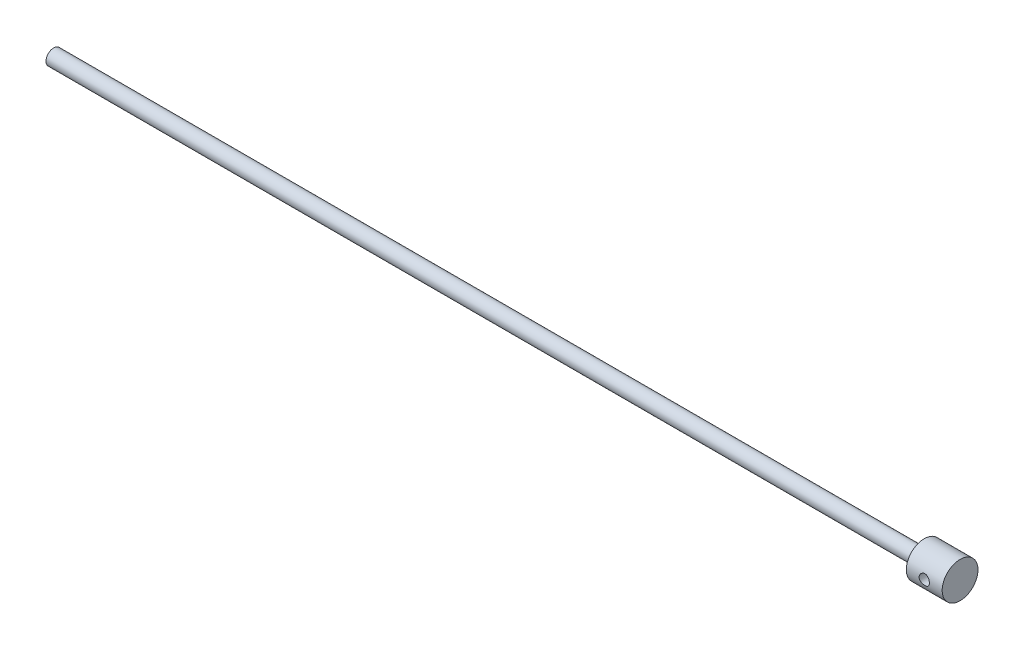
ISO-10303-21;
HEADER;
FILE_DESCRIPTION(('STEP AP214'),'2;1');
FILE_NAME('part.step','',(''),(''),'','','');
FILE_SCHEMA(('AUTOMOTIVE_DESIGN { 1 0 10303 214 1 1 1 1 }'));
ENDSEC;
DATA;
#1=APPLICATION_CONTEXT('core data for automotive mechanical design processes');
#2=APPLICATION_PROTOCOL_DEFINITION('international standard','automotive_design',2000,#1);
#3=PRODUCT_CONTEXT('',#1,'mechanical');
#4=PRODUCT('Part','Part','',(#3));
#5=PRODUCT_RELATED_PRODUCT_CATEGORY('part','',(#4));
#6=PRODUCT_DEFINITION_FORMATION('','',#4);
#7=PRODUCT_DEFINITION_CONTEXT('part definition',#1,'design');
#8=PRODUCT_DEFINITION('design','',#6,#7);
#9=PRODUCT_DEFINITION_SHAPE('','',#8);
#10=(LENGTH_UNIT() NAMED_UNIT(*) SI_UNIT(.MILLI.,.METRE.));
#11=(NAMED_UNIT(*) PLANE_ANGLE_UNIT() SI_UNIT($,.RADIAN.));
#12=(NAMED_UNIT(*) SI_UNIT($,.STERADIAN.) SOLID_ANGLE_UNIT());
#13=UNCERTAINTY_MEASURE_WITH_UNIT(LENGTH_MEASURE(1.E-05),#10,'distance_accuracy_value','');
#14=(GEOMETRIC_REPRESENTATION_CONTEXT(3) GLOBAL_UNCERTAINTY_ASSIGNED_CONTEXT((#13)) GLOBAL_UNIT_ASSIGNED_CONTEXT((#10,
#11,#12)) REPRESENTATION_CONTEXT('',''));
#15=CARTESIAN_POINT('',(0.,0.,0.));
#16=DIRECTION('',(0.,0.,1.));
#17=DIRECTION('',(1.,0.,0.));
#18=AXIS2_PLACEMENT_3D('',#15,#16,#17);
#19=CARTESIAN_POINT('',(-850.,0.,0.));
#20=DIRECTION('',(1.,0.,0.));
#21=DIRECTION('',(0.,0.,-1.));
#22=AXIS2_PLACEMENT_3D('',#19,#20,#21);
#23=CYLINDRICAL_SURFACE('',#22,7.5);
#24=CARTESIAN_POINT('',(-850.,0.,0.));
#25=DIRECTION('',(1.,0.,0.));
#26=DIRECTION('',(0.,0.,-1.));
#27=AXIS2_PLACEMENT_3D('',#24,#25,#26);
#28=CIRCLE('',#27,7.5);
#29=CARTESIAN_POINT('',(-850.,0.,-7.5));
#30=VERTEX_POINT('',#29);
#31=EDGE_CURVE('E47',#30,#30,#28,.T.);
#32=ORIENTED_EDGE('',*,*,#31,.T.);
#33=EDGE_LOOP('',(#32));
#34=FACE_BOUND('',#33,.T.);
#35=CARTESIAN_POINT('',(0.,0.,0.));
#36=DIRECTION('',(1.,0.,0.));
#37=DIRECTION('',(0.,0.,-1.));
#38=AXIS2_PLACEMENT_3D('',#35,#36,#37);
#39=CIRCLE('',#38,7.5);
#40=CARTESIAN_POINT('',(0.,0.,-7.5));
#41=VERTEX_POINT('',#40);
#42=EDGE_CURVE('E51',#41,#41,#39,.T.);
#43=ORIENTED_EDGE('',*,*,#42,.F.);
#44=EDGE_LOOP('',(#43));
#45=FACE_BOUND('',#44,.T.);
#46=ADVANCED_FACE('F32',(#34,#45),#23,.T.);
#47=CARTESIAN_POINT('',(-850.,0.,0.));
#48=DIRECTION('',(1.,0.,0.));
#49=DIRECTION('',(0.,0.,-1.));
#50=AXIS2_PLACEMENT_3D('',#47,#48,#49);
#51=PLANE('',#50);
#52=ORIENTED_EDGE('',*,*,#31,.F.);
#53=EDGE_LOOP('',(#52));
#54=FACE_BOUND('',#53,.T.);
#55=ADVANCED_FACE('F77',(#54),#51,.F.);
#56=CARTESIAN_POINT('',(35.,0.,0.));
#57=DIRECTION('',(-1.,0.,0.));
#58=DIRECTION('',(0.,0.,1.));
#59=AXIS2_PLACEMENT_3D('',#56,#57,#58);
#60=CYLINDRICAL_SURFACE('',#59,17.5);
#61=CARTESIAN_POINT('',(22.5,0.,-17.5));
#62=CARTESIAN_POINT('',(22.4999951510951,0.274887255943128,-17.4999967323586));
#63=CARTESIAN_POINT('',(22.4772555275597,0.549824369681453,-17.4934604350511));
#64=CARTESIAN_POINT('',(22.3870893247442,1.09172997799247,-17.4680226486276));
#65=CARTESIAN_POINT('',(22.3196458348148,1.35869541707404,-17.4491164802521));
#66=CARTESIAN_POINT('',(22.1424799039587,1.87676075184468,-17.4010172837268));
#67=CARTESIAN_POINT('',(22.0328164096201,2.12788220212056,-17.3718386026585));
#68=CARTESIAN_POINT('',(21.7745550213041,2.60817190282318,-17.3062494579136));
#69=CARTESIAN_POINT('',(21.6259530537741,2.83733785294541,-17.2698382377007));
#70=CARTESIAN_POINT('',(21.2899124733177,3.27323611714736,-17.1926183656394));
#71=CARTESIAN_POINT('',(21.1016381153618,3.47930930595233,-17.1517260486293));
#72=CARTESIAN_POINT('',(20.6933806421558,3.85742839481089,-17.0706683728915));
#73=CARTESIAN_POINT('',(20.4733927809195,4.02946919269461,-17.0305031239854));
#74=CARTESIAN_POINT('',(20.0025160430226,4.33799475016071,-16.9545753718829));
#75=CARTESIAN_POINT('',(19.7510950373375,4.47369552758352,-16.9189175626436));
#76=CARTESIAN_POINT('',(19.2278199706235,4.7006292638497,-16.8572835960235));
#77=CARTESIAN_POINT('',(18.9559703198242,4.79187178889368,-16.8313053561473));
#78=CARTESIAN_POINT('',(18.4069130920848,4.92496082534619,-16.7928402048756));
#79=CARTESIAN_POINT('',(18.1300215930753,4.9680138300687,-16.7800244641586));
#80=CARTESIAN_POINT('',(17.5726721288899,5.00726669473215,-16.7683552051415));
#81=CARTESIAN_POINT('',(17.2922149518936,5.00347673524998,-16.769498653032));
#82=CARTESIAN_POINT('',(16.7453284713328,4.95010336906261,-16.7853258599179));
#83=CARTESIAN_POINT('',(16.4787391219636,4.90200814317314,-16.7995695662338));
#84=CARTESIAN_POINT('',(15.9575819508506,4.76378465210904,-16.8392837083571));
#85=CARTESIAN_POINT('',(15.7030152181801,4.67365258702332,-16.8647551590827));
#86=CARTESIAN_POINT('',(15.2093843889463,4.45276702845641,-16.9244215882327));
#87=CARTESIAN_POINT('',(14.9705573190027,4.32151377932501,-16.95872291023));
#88=CARTESIAN_POINT('',(14.5178085969596,4.02245947919413,-17.0321304219627));
#89=CARTESIAN_POINT('',(14.3038925056608,3.8546502918328,-17.0712376805236));
#90=CARTESIAN_POINT('',(13.898569060986,3.47975999182636,-17.151656266434));
#91=CARTESIAN_POINT('',(13.7083138100825,3.27143718711354,-17.1929951143159));
#92=CARTESIAN_POINT('',(13.3651849908988,2.82533070596533,-17.2719061804519));
#93=CARTESIAN_POINT('',(13.2123133598956,2.58754550370467,-17.3094782034438));
#94=CARTESIAN_POINT('',(12.947678163065,2.08730768272867,-17.3769132016394));
#95=CARTESIAN_POINT('',(12.8361492829896,1.82472454452503,-17.4067318874312));
#96=CARTESIAN_POINT('',(12.6591652714579,1.28348307491865,-17.4549812871892));
#97=CARTESIAN_POINT('',(12.5936985268868,1.00482881452536,-17.4734148714063));
#98=CARTESIAN_POINT('',(12.5125667857264,0.449165971610878,-17.4963718628669));
#99=CARTESIAN_POINT('',(12.4953382615674,0.17240336715127,-17.501331821265));
#100=CARTESIAN_POINT('',(12.5068181657526,-0.380066317013958,-17.4980521176773));
#101=CARTESIAN_POINT('',(12.5355210821148,-0.65577351939277,-17.4898140395157));
#102=CARTESIAN_POINT('',(12.6367761107906,-1.19254658357579,-17.4613481671301));
#103=CARTESIAN_POINT('',(12.7084329533085,-1.45379552933711,-17.4413653254419));
#104=CARTESIAN_POINT('',(12.8925012549617,-1.9605217155141,-17.3916999685472));
#105=CARTESIAN_POINT('',(13.0049174272233,-2.20599712812179,-17.3620163316471));
#106=CARTESIAN_POINT('',(13.2700583416128,-2.68010421280008,-17.2952490292284));
#107=CARTESIAN_POINT('',(13.4236029970633,-2.90825621635022,-17.2580190794575));
#108=CARTESIAN_POINT('',(13.7656312648777,-3.33609632014869,-17.180448677462));
#109=CARTESIAN_POINT('',(13.9541228251614,-3.53577792710763,-17.1401075188813));
#110=CARTESIAN_POINT('',(14.3680233551237,-3.90776607085016,-17.0592154907323));
#111=CARTESIAN_POINT('',(14.5944381888979,-4.07896356851775,-17.0187009214433));
#112=CARTESIAN_POINT('',(15.0736564715614,-4.380988290169,-16.9434723683839));
#113=CARTESIAN_POINT('',(15.3264590019272,-4.51181691871705,-16.9087581828186));
#114=CARTESIAN_POINT('',(15.850228027439,-4.72843635295665,-16.8494662810178));
#115=CARTESIAN_POINT('',(16.1210894087477,-4.81446583099021,-16.8248350005383));
#116=CARTESIAN_POINT('',(16.6742748389333,-4.93948625169788,-16.7885614169356));
#117=CARTESIAN_POINT('',(16.9565953876774,-4.9784914475439,-16.7769151780959));
#118=CARTESIAN_POINT('',(17.5132400823757,-5.00745060616827,-16.7682925774812));
#119=CARTESIAN_POINT('',(17.7874637614812,-4.99920069109392,-16.7707790176036));
#120=CARTESIAN_POINT('',(18.3304368267331,-4.93811777392153,-16.7888649275624));
#121=CARTESIAN_POINT('',(18.5991863952422,-4.88528625949613,-16.8044639598361));
#122=CARTESIAN_POINT('',(19.1209459278904,-4.73764922042289,-16.8466744296963));
#123=CARTESIAN_POINT('',(19.3740884675196,-4.64327729466074,-16.8731719264076));
#124=CARTESIAN_POINT('',(19.8611468362388,-4.41557373253792,-16.9341825708695));
#125=CARTESIAN_POINT('',(20.0950592531853,-4.28223520107837,-16.9686971370099));
#126=CARTESIAN_POINT('',(20.545458804511,-3.97516366337117,-17.0432917237999));
#127=CARTESIAN_POINT('',(20.7611034783543,-3.80023069306842,-17.0835190794904));
#128=CARTESIAN_POINT('',(21.1605597395252,-3.41714960094825,-17.164246127292));
#129=CARTESIAN_POINT('',(21.3443632977772,-3.20899312682136,-17.2047458854255));
#130=CARTESIAN_POINT('',(21.6795929608164,-2.75893580216352,-17.282698989313));
#131=CARTESIAN_POINT('',(21.830067468174,-2.51630625589946,-17.3200475259364));
#132=CARTESIAN_POINT('',(22.0878644625551,-2.00812632411665,-17.3862848944483));
#133=CARTESIAN_POINT('',(22.1952105298327,-1.74258856028685,-17.4151783467569));
#134=CARTESIAN_POINT('',(22.3521188784886,-1.23229078833759,-17.4581836181329));
#135=CARTESIAN_POINT('',(22.4074338417114,-0.989407519060978,-17.473742109052));
#136=CARTESIAN_POINT('',(22.4813741431054,-0.497695921965919,-17.4946510963036));
#137=CARTESIAN_POINT('',(22.5000043899422,-0.24886839404023,-17.5000029583499));
#138=CARTESIAN_POINT('',(22.5,0.,-17.5));
#139=B_SPLINE_CURVE_WITH_KNOTS('',3,(#61,#62,#63,#64,#65,#66,#67,#68,#69,#70,#71,#72,#73,#74,
#75,#76,#77,#78,#79,#80,#81,#82,#83,#84,#85,#86,#87,#88,#89,#90,#91,#92,#93,#94,#95,#96,#97,#98,
#99,#100,#101,#102,#103,#104,#105,#106,#107,#108,#109,#110,#111,#112,#113,#114,#115,#116,#117,
#118,#119,#120,#121,#122,#123,#124,#125,#126,#127,#128,#129,#130,#131,#132,#133,#134,#135,#136,
#137,#138),.UNSPECIFIED.,.T.,.F.,(4,2,2,2,2,2,2,2,2,2,2,2,2,2,2,2,2,2,2,2,2,2,2,2,2,2,2,2,2,2,2,
2,2,2,2,2,2,2,4),(0.,0.82374828135586,1.64780834948795,2.47072203223836,3.2937218385879,
4.13619528826953,4.97879494684284,5.83832688250144,6.69767378862024,7.53498774656874,
8.37211973078083,9.18211964575845,9.99219279470076,10.8125200823279,11.6330301394812,
12.4844625151102,13.3359390039338,14.1921775276588,15.0482001004129,15.8761364425026,
16.7039734359138,17.5151285120356,18.3263774144358,19.1551881336589,19.9841875797423,
20.840302622156,21.6963878741801,22.5478643342011,23.399082644741,24.2181670405214,
25.0372241048183,25.8479274074505,26.6587742501083,27.4966914224279,28.3348195778807,
29.1944494744229,30.053608731021,30.7994867011175,31.5452648608618),.UNSPECIFIED.);
#140=CARTESIAN_POINT('',(22.5,0.,-17.5));
#141=VERTEX_POINT('',#140);
#142=EDGE_CURVE('E10',#141,#141,#139,.T.);
#143=ORIENTED_EDGE('',*,*,#142,.T.);
#144=EDGE_LOOP('',(#143));
#145=FACE_BOUND('',#144,.T.);
#146=CARTESIAN_POINT('',(22.5,0.,17.5));
#147=CARTESIAN_POINT('',(22.4999951510951,-0.274887255943128,17.4999967323586));
#148=CARTESIAN_POINT('',(22.4772555275597,-0.549824369681453,17.4934604350511));
#149=CARTESIAN_POINT('',(22.3870893247442,-1.09172997799247,17.4680226486276));
#150=CARTESIAN_POINT('',(22.3196458348148,-1.35869541707404,17.4491164802521));
#151=CARTESIAN_POINT('',(22.1424799039587,-1.87676075184468,17.4010172837268));
#152=CARTESIAN_POINT('',(22.0328164096201,-2.12788220212056,17.3718386026585));
#153=CARTESIAN_POINT('',(21.7745550213041,-2.60817190282318,17.3062494579136));
#154=CARTESIAN_POINT('',(21.6259530537741,-2.83733785294541,17.2698382377007));
#155=CARTESIAN_POINT('',(21.2899124733177,-3.27323611714736,17.1926183656394));
#156=CARTESIAN_POINT('',(21.1016381153618,-3.47930930595233,17.1517260486293));
#157=CARTESIAN_POINT('',(20.6933806421558,-3.85742839481089,17.0706683728915));
#158=CARTESIAN_POINT('',(20.4733927809195,-4.02946919269461,17.0305031239854));
#159=CARTESIAN_POINT('',(20.0025160430226,-4.33799475016071,16.9545753718829));
#160=CARTESIAN_POINT('',(19.7510950373375,-4.47369552758352,16.9189175626436));
#161=CARTESIAN_POINT('',(19.2278199706235,-4.7006292638497,16.8572835960235));
#162=CARTESIAN_POINT('',(18.9559703198242,-4.79187178889368,16.8313053561473));
#163=CARTESIAN_POINT('',(18.4069130920848,-4.92496082534619,16.7928402048756));
#164=CARTESIAN_POINT('',(18.1300215930753,-4.9680138300687,16.7800244641586));
#165=CARTESIAN_POINT('',(17.5726721288899,-5.00726669473215,16.7683552051415));
#166=CARTESIAN_POINT('',(17.2922149518936,-5.00347673524998,16.769498653032));
#167=CARTESIAN_POINT('',(16.7453284713328,-4.95010336906261,16.7853258599179));
#168=CARTESIAN_POINT('',(16.4787391219636,-4.90200814317314,16.7995695662338));
#169=CARTESIAN_POINT('',(15.9575819508506,-4.76378465210904,16.8392837083571));
#170=CARTESIAN_POINT('',(15.7030152181801,-4.67365258702332,16.8647551590827));
#171=CARTESIAN_POINT('',(15.2093843889463,-4.45276702845641,16.9244215882327));
#172=CARTESIAN_POINT('',(14.9705573190027,-4.32151377932501,16.95872291023));
#173=CARTESIAN_POINT('',(14.5178085969596,-4.02245947919413,17.0321304219627));
#174=CARTESIAN_POINT('',(14.3038925056608,-3.8546502918328,17.0712376805236));
#175=CARTESIAN_POINT('',(13.898569060986,-3.47975999182636,17.151656266434));
#176=CARTESIAN_POINT('',(13.7083138100825,-3.27143718711354,17.1929951143159));
#177=CARTESIAN_POINT('',(13.3651849908988,-2.82533070596533,17.2719061804519));
#178=CARTESIAN_POINT('',(13.2123133598956,-2.58754550370467,17.3094782034438));
#179=CARTESIAN_POINT('',(12.947678163065,-2.08730768272867,17.3769132016394));
#180=CARTESIAN_POINT('',(12.8361492829896,-1.82472454452503,17.4067318874312));
#181=CARTESIAN_POINT('',(12.6591652714579,-1.28348307491865,17.4549812871892));
#182=CARTESIAN_POINT('',(12.5936985268868,-1.00482881452536,17.4734148714063));
#183=CARTESIAN_POINT('',(12.5125667857264,-0.449165971610878,17.4963718628669));
#184=CARTESIAN_POINT('',(12.4953382615674,-0.17240336715127,17.501331821265));
#185=CARTESIAN_POINT('',(12.5068181657526,0.380066317013958,17.4980521176773));
#186=CARTESIAN_POINT('',(12.5355210821148,0.65577351939277,17.4898140395157));
#187=CARTESIAN_POINT('',(12.6367761107906,1.19254658357579,17.4613481671301));
#188=CARTESIAN_POINT('',(12.7084329533085,1.45379552933711,17.4413653254419));
#189=CARTESIAN_POINT('',(12.8925012549617,1.9605217155141,17.3916999685472));
#190=CARTESIAN_POINT('',(13.0049174272233,2.20599712812179,17.3620163316471));
#191=CARTESIAN_POINT('',(13.2700583416128,2.68010421280008,17.2952490292284));
#192=CARTESIAN_POINT('',(13.4236029970633,2.90825621635022,17.2580190794575));
#193=CARTESIAN_POINT('',(13.7656312648777,3.33609632014869,17.180448677462));
#194=CARTESIAN_POINT('',(13.9541228251614,3.53577792710763,17.1401075188813));
#195=CARTESIAN_POINT('',(14.3680233551237,3.90776607085016,17.0592154907323));
#196=CARTESIAN_POINT('',(14.5944381888979,4.07896356851775,17.0187009214433));
#197=CARTESIAN_POINT('',(15.0736564715614,4.380988290169,16.9434723683839));
#198=CARTESIAN_POINT('',(15.3264590019272,4.51181691871705,16.9087581828186));
#199=CARTESIAN_POINT('',(15.850228027439,4.72843635295665,16.8494662810178));
#200=CARTESIAN_POINT('',(16.1210894087477,4.81446583099021,16.8248350005383));
#201=CARTESIAN_POINT('',(16.6742748389333,4.93948625169788,16.7885614169356));
#202=CARTESIAN_POINT('',(16.9565953876774,4.9784914475439,16.7769151780959));
#203=CARTESIAN_POINT('',(17.5132400823757,5.00745060616827,16.7682925774812));
#204=CARTESIAN_POINT('',(17.7874637614812,4.99920069109392,16.7707790176036));
#205=CARTESIAN_POINT('',(18.3304368267331,4.93811777392153,16.7888649275624));
#206=CARTESIAN_POINT('',(18.5991863952422,4.88528625949613,16.8044639598361));
#207=CARTESIAN_POINT('',(19.1209459278904,4.73764922042289,16.8466744296963));
#208=CARTESIAN_POINT('',(19.3740884675196,4.64327729466074,16.8731719264076));
#209=CARTESIAN_POINT('',(19.8611468362388,4.41557373253792,16.9341825708695));
#210=CARTESIAN_POINT('',(20.0950592531853,4.28223520107837,16.9686971370099));
#211=CARTESIAN_POINT('',(20.545458804511,3.97516366337117,17.0432917237999));
#212=CARTESIAN_POINT('',(20.7611034783543,3.80023069306842,17.0835190794904));
#213=CARTESIAN_POINT('',(21.1605597395252,3.41714960094825,17.164246127292));
#214=CARTESIAN_POINT('',(21.3443632977772,3.20899312682136,17.2047458854255));
#215=CARTESIAN_POINT('',(21.6795929608164,2.75893580216352,17.282698989313));
#216=CARTESIAN_POINT('',(21.830067468174,2.51630625589946,17.3200475259364));
#217=CARTESIAN_POINT('',(22.0878644625551,2.00812632411665,17.3862848944483));
#218=CARTESIAN_POINT('',(22.1952105298327,1.74258856028685,17.4151783467569));
#219=CARTESIAN_POINT('',(22.3521188784886,1.23229078833759,17.4581836181329));
#220=CARTESIAN_POINT('',(22.4074338417114,0.989407519060978,17.473742109052));
#221=CARTESIAN_POINT('',(22.4813741431054,0.497695921965919,17.4946510963036));
#222=CARTESIAN_POINT('',(22.5000043899422,0.24886839404023,17.5000029583499));
#223=CARTESIAN_POINT('',(22.5,0.,17.5));
#224=B_SPLINE_CURVE_WITH_KNOTS('',3,(#146,#147,#148,#149,#150,#151,#152,#153,#154,#155,#156,
#157,#158,#159,#160,#161,#162,#163,#164,#165,#166,#167,#168,#169,#170,#171,#172,#173,#174,#175,
#176,#177,#178,#179,#180,#181,#182,#183,#184,#185,#186,#187,#188,#189,#190,#191,#192,#193,#194,
#195,#196,#197,#198,#199,#200,#201,#202,#203,#204,#205,#206,#207,#208,#209,#210,#211,#212,#213,
#214,#215,#216,#217,#218,#219,#220,#221,#222,#223),.UNSPECIFIED.,.T.,.F.,(4,2,2,2,2,2,2,2,2,2,2,
2,2,2,2,2,2,2,2,2,2,2,2,2,2,2,2,2,2,2,2,2,2,2,2,2,2,2,4),(0.,0.82374828135586,1.64780834948795,
2.47072203223836,3.2937218385879,4.13619528826953,4.97879494684284,5.83832688250144,
6.69767378862024,7.53498774656874,8.37211973078083,9.18211964575845,9.99219279470076,
10.8125200823279,11.6330301394812,12.4844625151102,13.3359390039338,14.1921775276588,
15.0482001004129,15.8761364425026,16.7039734359138,17.5151285120356,18.3263774144358,
19.1551881336589,19.9841875797423,20.840302622156,21.6963878741801,22.5478643342011,
23.399082644741,24.2181670405214,25.0372241048183,25.8479274074505,26.6587742501083,
27.4966914224279,28.3348195778807,29.1944494744229,30.053608731021,30.7994867011175,
31.5452648608618),.UNSPECIFIED.);
#225=CARTESIAN_POINT('',(22.5,0.,17.5));
#226=VERTEX_POINT('',#225);
#227=EDGE_CURVE('E43',#226,#226,#224,.T.);
#228=ORIENTED_EDGE('',*,*,#227,.T.);
#229=EDGE_LOOP('',(#228));
#230=FACE_BOUND('',#229,.T.);
#231=CARTESIAN_POINT('',(35.,0.,0.));
#232=DIRECTION('',(1.,0.,0.));
#233=DIRECTION('',(0.,0.,-1.));
#234=AXIS2_PLACEMENT_3D('',#231,#232,#233);
#235=CIRCLE('',#234,17.5);
#236=CARTESIAN_POINT('',(35.,0.,-17.5));
#237=VERTEX_POINT('',#236);
#238=EDGE_CURVE('E86',#237,#237,#235,.T.);
#239=ORIENTED_EDGE('',*,*,#238,.F.);
#240=EDGE_LOOP('',(#239));
#241=FACE_BOUND('',#240,.T.);
#242=CARTESIAN_POINT('',(0.,0.,0.));
#243=DIRECTION('',(1.,0.,0.));
#244=DIRECTION('',(0.,0.,-1.));
#245=AXIS2_PLACEMENT_3D('',#242,#243,#244);
#246=CIRCLE('',#245,17.5);
#247=CARTESIAN_POINT('',(0.,0.,-17.5));
#248=VERTEX_POINT('',#247);
#249=EDGE_CURVE('E88',#248,#248,#246,.T.);
#250=ORIENTED_EDGE('',*,*,#249,.T.);
#251=EDGE_LOOP('',(#250));
#252=FACE_BOUND('',#251,.T.);
#253=ADVANCED_FACE('F57',(#145,#230,#241,#252),#60,.T.);
#254=CARTESIAN_POINT('',(35.,0.,0.));
#255=DIRECTION('',(1.,0.,0.));
#256=DIRECTION('',(0.,0.,-1.));
#257=AXIS2_PLACEMENT_3D('',#254,#255,#256);
#258=PLANE('',#257);
#259=ORIENTED_EDGE('',*,*,#238,.T.);
#260=EDGE_LOOP('',(#259));
#261=FACE_BOUND('',#260,.T.);
#262=ADVANCED_FACE('F66',(#261),#258,.T.);
#263=CARTESIAN_POINT('',(0.,0.,0.));
#264=DIRECTION('',(1.,0.,0.));
#265=DIRECTION('',(0.,0.,-1.));
#266=AXIS2_PLACEMENT_3D('',#263,#264,#265);
#267=PLANE('',#266);
#268=ORIENTED_EDGE('',*,*,#42,.T.);
#269=EDGE_LOOP('',(#268));
#270=FACE_BOUND('',#269,.T.);
#271=ORIENTED_EDGE('',*,*,#249,.F.);
#272=EDGE_LOOP('',(#271));
#273=FACE_BOUND('',#272,.T.);
#274=ADVANCED_FACE('F64',(#270,#273),#267,.F.);
#275=CARTESIAN_POINT('',(17.5,0.,-17.5));
#276=DIRECTION('',(0.,0.,1.));
#277=DIRECTION('',(1.,0.,0.));
#278=AXIS2_PLACEMENT_3D('',#275,#276,#277);
#279=CYLINDRICAL_SURFACE('',#278,5.);
#280=ORIENTED_EDGE('',*,*,#227,.F.);
#281=EDGE_LOOP('',(#280));
#282=FACE_BOUND('',#281,.T.);
#283=ORIENTED_EDGE('',*,*,#142,.F.);
#284=EDGE_LOOP('',(#283));
#285=FACE_BOUND('',#284,.T.);
#286=ADVANCED_FACE('F60',(#282,#285),#279,.F.);
#287=CLOSED_SHELL('',(#46,#55,#253,#262,#274,#286));
#288=MANIFOLD_SOLID_BREP('B2',#287);
#289=ADVANCED_BREP_SHAPE_REPRESENTATION('',(#18,#288),#14);
#290=SHAPE_DEFINITION_REPRESENTATION(#9,#289);
ENDSEC;
END-ISO-10303-21;
